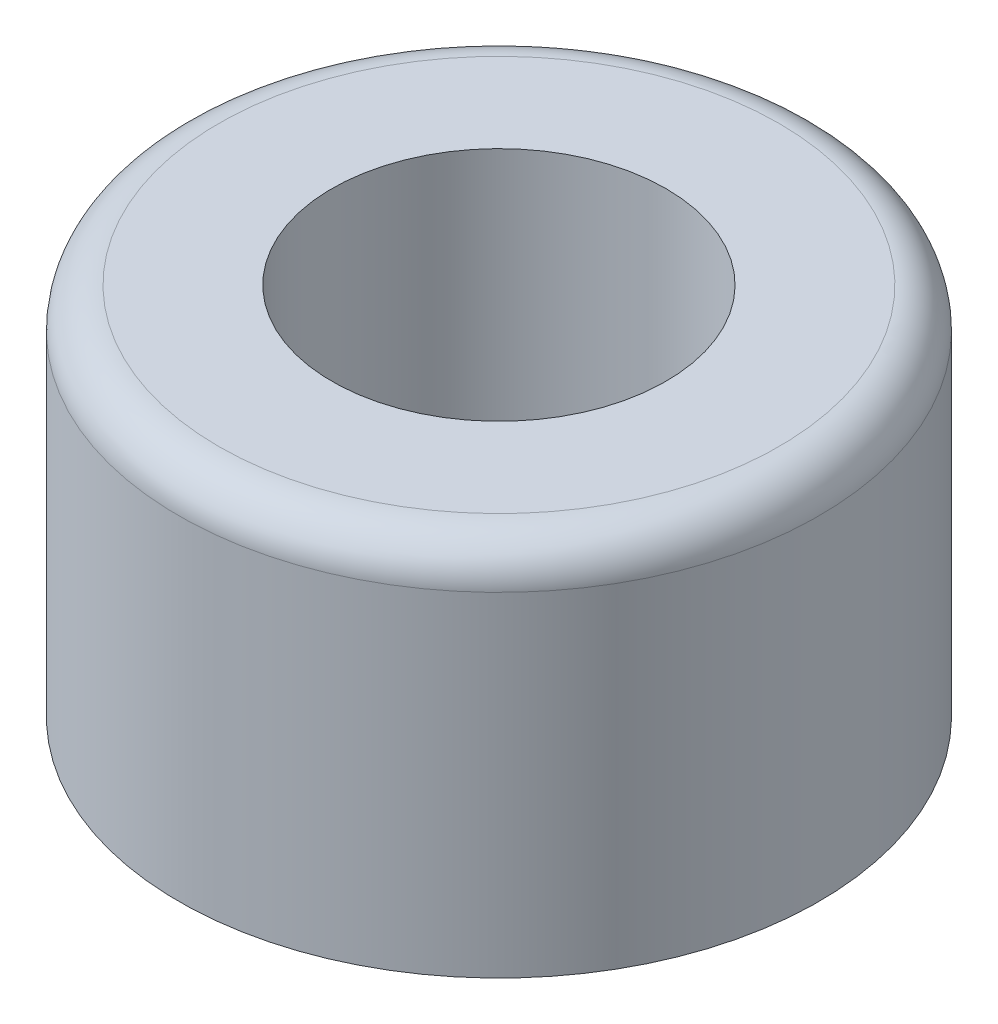
ISO-10303-21;
HEADER;
FILE_DESCRIPTION(('STEP AP214'),'2;1');
FILE_NAME('part.step','',(''),(''),'','','');
FILE_SCHEMA(('AUTOMOTIVE_DESIGN { 1 0 10303 214 1 1 1 1 }'));
ENDSEC;
DATA;
#1=APPLICATION_CONTEXT('core data for automotive mechanical design processes');
#2=APPLICATION_PROTOCOL_DEFINITION('international standard','automotive_design',2000,#1);
#3=PRODUCT_CONTEXT('',#1,'mechanical');
#4=PRODUCT('Part','Part','',(#3));
#5=PRODUCT_RELATED_PRODUCT_CATEGORY('part','',(#4));
#6=PRODUCT_DEFINITION_FORMATION('','',#4);
#7=PRODUCT_DEFINITION_CONTEXT('part definition',#1,'design');
#8=PRODUCT_DEFINITION('design','',#6,#7);
#9=PRODUCT_DEFINITION_SHAPE('','',#8);
#10=(LENGTH_UNIT() NAMED_UNIT(*) SI_UNIT(.MILLI.,.METRE.));
#11=(NAMED_UNIT(*) PLANE_ANGLE_UNIT() SI_UNIT($,.RADIAN.));
#12=(NAMED_UNIT(*) SI_UNIT($,.STERADIAN.) SOLID_ANGLE_UNIT());
#13=UNCERTAINTY_MEASURE_WITH_UNIT(LENGTH_MEASURE(1.E-05),#10,'distance_accuracy_value','');
#14=(GEOMETRIC_REPRESENTATION_CONTEXT(3) GLOBAL_UNCERTAINTY_ASSIGNED_CONTEXT((#13)) GLOBAL_UNIT_ASSIGNED_CONTEXT((#10,
#11,#12)) REPRESENTATION_CONTEXT('',''));
#15=CARTESIAN_POINT('',(0.,0.,0.));
#16=DIRECTION('',(0.,0.,1.));
#17=DIRECTION('',(1.,0.,0.));
#18=AXIS2_PLACEMENT_3D('',#15,#16,#17);
#19=CARTESIAN_POINT('',(0.,2.3749,0.));
#20=DIRECTION('',(0.,1.,0.));
#21=DIRECTION('',(0.,0.,1.));
#22=AXIS2_PLACEMENT_3D('',#19,#20,#21);
#23=PLANE('',#22);
#24=CARTESIAN_POINT('',(0.,2.3749,0.));
#25=DIRECTION('',(0.,-1.,0.));
#26=DIRECTION('',(0.,0.,-1.));
#27=AXIS2_PLACEMENT_3D('',#24,#25,#26);
#28=CIRCLE('',#27,2.1209);
#29=CARTESIAN_POINT('',(0.,2.3749,-2.1209));
#30=VERTEX_POINT('',#29);
#31=EDGE_CURVE('E38',#30,#30,#28,.T.);
#32=ORIENTED_EDGE('',*,*,#31,.T.);
#33=EDGE_LOOP('',(#32));
#34=FACE_BOUND('',#33,.T.);
#35=CARTESIAN_POINT('',(0.,2.3749,0.));
#36=DIRECTION('',(0.,-1.,0.));
#37=DIRECTION('',(0.,0.,-1.));
#38=AXIS2_PLACEMENT_3D('',#35,#36,#37);
#39=CIRCLE('',#38,3.556);
#40=CARTESIAN_POINT('',(0.,2.3749,-3.556));
#41=VERTEX_POINT('',#40);
#42=CARTESIAN_POINT('',(0.,2.3749,3.556));
#43=VERTEX_POINT('',#42);
#44=EDGE_CURVE('E32',#41,#43,#39,.T.);
#45=ORIENTED_EDGE('',*,*,#44,.F.);
#46=CARTESIAN_POINT('',(0.,2.3749,0.));
#47=DIRECTION('',(0.,-1.,0.));
#48=DIRECTION('',(0.,0.,1.));
#49=AXIS2_PLACEMENT_3D('',#46,#47,#48);
#50=CIRCLE('',#49,3.556);
#51=EDGE_CURVE('E36',#43,#41,#50,.T.);
#52=ORIENTED_EDGE('',*,*,#51,.F.);
#53=EDGE_LOOP('',(#45,#52));
#54=FACE_BOUND('',#53,.T.);
#55=ADVANCED_FACE('F14',(#34,#54),#23,.T.);
#56=CARTESIAN_POINT('',(0.,2.3749,0.));
#57=DIRECTION('',(0.,-1.,0.));
#58=DIRECTION('',(0.,0.,-1.));
#59=AXIS2_PLACEMENT_3D('',#56,#57,#58);
#60=CYLINDRICAL_SURFACE('',#59,2.1209);
#61=CARTESIAN_POINT('',(0.,-2.3749,0.));
#62=DIRECTION('',(0.,-1.,0.));
#63=DIRECTION('',(0.,0.,-1.));
#64=AXIS2_PLACEMENT_3D('',#61,#62,#63);
#65=CIRCLE('',#64,2.1209);
#66=CARTESIAN_POINT('',(0.,-2.3749,-2.1209));
#67=VERTEX_POINT('',#66);
#68=EDGE_CURVE('E42',#67,#67,#65,.T.);
#69=ORIENTED_EDGE('',*,*,#68,.T.);
#70=EDGE_LOOP('',(#69));
#71=FACE_BOUND('',#70,.T.);
#72=ORIENTED_EDGE('',*,*,#31,.F.);
#73=EDGE_LOOP('',(#72));
#74=FACE_BOUND('',#73,.T.);
#75=ADVANCED_FACE('F58',(#71,#74),#60,.F.);
#76=CARTESIAN_POINT('',(0.,1.8669,0.));
#77=DIRECTION('',(0.,1.,0.));
#78=DIRECTION('',(0.,0.,1.));
#79=AXIS2_PLACEMENT_3D('',#76,#77,#78);
#80=TOROIDAL_SURFACE('',#79,3.556,0.508);
#81=CARTESIAN_POINT('',(0.,1.8669,0.));
#82=DIRECTION('',(0.,-1.,0.));
#83=DIRECTION('',(0.,0.,-1.));
#84=AXIS2_PLACEMENT_3D('',#81,#82,#83);
#85=CIRCLE('',#84,4.064);
#86=CARTESIAN_POINT('',(0.,1.8669,-4.064));
#87=VERTEX_POINT('',#86);
#88=EDGE_CURVE('E26',#87,#87,#85,.T.);
#89=ORIENTED_EDGE('',*,*,#88,.F.);
#90=EDGE_LOOP('',(#89));
#91=FACE_BOUND('',#90,.T.);
#92=ORIENTED_EDGE('',*,*,#51,.T.);
#93=ORIENTED_EDGE('',*,*,#44,.T.);
#94=EDGE_LOOP('',(#92,#93));
#95=FACE_BOUND('',#94,.T.);
#96=ADVANCED_FACE('F41',(#91,#95),#80,.T.);
#97=CARTESIAN_POINT('',(0.,-2.3749,0.));
#98=DIRECTION('',(0.,1.,0.));
#99=DIRECTION('',(0.,0.,1.));
#100=AXIS2_PLACEMENT_3D('',#97,#98,#99);
#101=PLANE('',#100);
#102=ORIENTED_EDGE('',*,*,#68,.F.);
#103=EDGE_LOOP('',(#102));
#104=FACE_BOUND('',#103,.T.);
#105=CARTESIAN_POINT('',(0.,-2.3749,0.));
#106=DIRECTION('',(0.,-1.,0.));
#107=DIRECTION('',(0.,0.,-1.));
#108=AXIS2_PLACEMENT_3D('',#105,#106,#107);
#109=CIRCLE('',#108,4.064);
#110=CARTESIAN_POINT('',(0.,-2.3749,-4.064));
#111=VERTEX_POINT('',#110);
#112=EDGE_CURVE('E9',#111,#111,#109,.F.);
#113=ORIENTED_EDGE('',*,*,#112,.F.);
#114=EDGE_LOOP('',(#113));
#115=FACE_BOUND('',#114,.T.);
#116=ADVANCED_FACE('F57',(#104,#115),#101,.F.);
#117=CARTESIAN_POINT('',(0.,2.3749,0.));
#118=DIRECTION('',(0.,-1.,0.));
#119=DIRECTION('',(0.,0.,-1.));
#120=AXIS2_PLACEMENT_3D('',#117,#118,#119);
#121=CYLINDRICAL_SURFACE('',#120,4.064);
#122=ORIENTED_EDGE('',*,*,#88,.T.);
#123=EDGE_LOOP('',(#122));
#124=FACE_BOUND('',#123,.T.);
#125=ORIENTED_EDGE('',*,*,#112,.T.);
#126=EDGE_LOOP('',(#125));
#127=FACE_BOUND('',#126,.T.);
#128=ADVANCED_FACE('F16',(#124,#127),#121,.T.);
#129=CLOSED_SHELL('',(#55,#75,#96,#116,#128));
#130=MANIFOLD_SOLID_BREP('B1',#129);
#131=ADVANCED_BREP_SHAPE_REPRESENTATION('',(#18,#130),#14);
#132=SHAPE_DEFINITION_REPRESENTATION(#9,#131);
ENDSEC;
END-ISO-10303-21;
